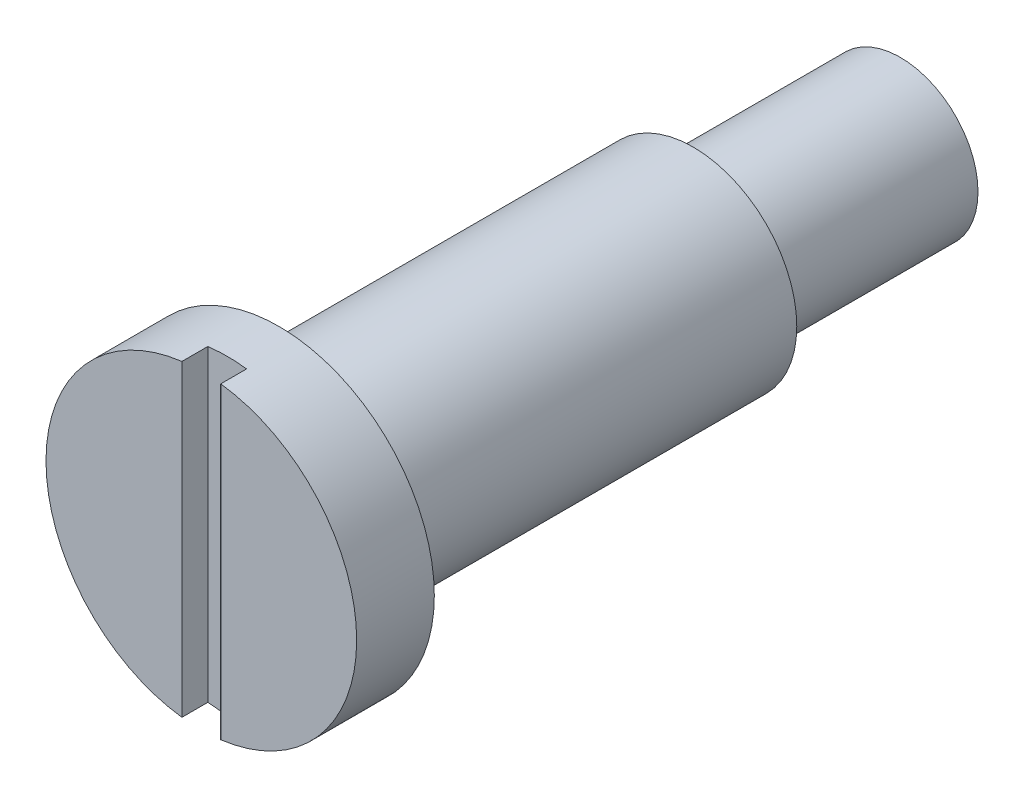
ISO-10303-21;
HEADER;
FILE_DESCRIPTION(('STEP AP214'),'2;1');
FILE_NAME('part.step','',(''),(''),'','','');
FILE_SCHEMA(('AUTOMOTIVE_DESIGN { 1 0 10303 214 1 1 1 1 }'));
ENDSEC;
DATA;
#1=APPLICATION_CONTEXT('core data for automotive mechanical design processes');
#2=APPLICATION_PROTOCOL_DEFINITION('international standard','automotive_design',2000,#1);
#3=PRODUCT_CONTEXT('',#1,'mechanical');
#4=PRODUCT('Part','Part','',(#3));
#5=PRODUCT_RELATED_PRODUCT_CATEGORY('part','',(#4));
#6=PRODUCT_DEFINITION_FORMATION('','',#4);
#7=PRODUCT_DEFINITION_CONTEXT('part definition',#1,'design');
#8=PRODUCT_DEFINITION('design','',#6,#7);
#9=PRODUCT_DEFINITION_SHAPE('','',#8);
#10=(LENGTH_UNIT() NAMED_UNIT(*) SI_UNIT(.MILLI.,.METRE.));
#11=(NAMED_UNIT(*) PLANE_ANGLE_UNIT() SI_UNIT($,.RADIAN.));
#12=(NAMED_UNIT(*) SI_UNIT($,.STERADIAN.) SOLID_ANGLE_UNIT());
#13=UNCERTAINTY_MEASURE_WITH_UNIT(LENGTH_MEASURE(1.E-05),#10,'distance_accuracy_value','');
#14=(GEOMETRIC_REPRESENTATION_CONTEXT(3) GLOBAL_UNCERTAINTY_ASSIGNED_CONTEXT((#13)) GLOBAL_UNIT_ASSIGNED_CONTEXT((#10,
#11,#12)) REPRESENTATION_CONTEXT('',''));
#15=CARTESIAN_POINT('',(0.,0.,0.));
#16=DIRECTION('',(0.,0.,1.));
#17=DIRECTION('',(1.,0.,0.));
#18=AXIS2_PLACEMENT_3D('',#15,#16,#17);
#19=CARTESIAN_POINT('',(0.,0.,0.));
#20=DIRECTION('',(0.,0.,-1.));
#21=DIRECTION('',(-1.,0.,0.));
#22=AXIS2_PLACEMENT_3D('',#19,#20,#21);
#23=PLANE('',#22);
#24=CARTESIAN_POINT('',(0.,0.,0.));
#25=DIRECTION('',(0.,0.,1.));
#26=DIRECTION('',(1.,0.,0.));
#27=AXIS2_PLACEMENT_3D('',#24,#25,#26);
#28=CIRCLE('',#27,6.);
#29=CARTESIAN_POINT('',(-0.75,5.95294044989533,0.));
#30=VERTEX_POINT('',#29);
#31=CARTESIAN_POINT('',(-0.749999999999998,-5.95294044989533,0.));
#32=VERTEX_POINT('',#31);
#33=EDGE_CURVE('E87',#30,#32,#28,.T.);
#34=ORIENTED_EDGE('',*,*,#33,.T.);
#35=DIRECTION('',(0.,-1.,0.));
#36=VECTOR('',#35,1.);
#37=CARTESIAN_POINT('',(-0.75,6.,0.));
#38=LINE('',#37,#36);
#39=EDGE_CURVE('E81',#30,#32,#38,.T.);
#40=ORIENTED_EDGE('',*,*,#39,.F.);
#41=EDGE_LOOP('',(#34,#40));
#42=FACE_BOUND('',#41,.T.);
#43=ADVANCED_FACE('F37',(#42),#23,.F.);
#44=CARTESIAN_POINT('',(0.750000000000001,-5.95294044989533,0.));
#45=VERTEX_POINT('',#44);
#46=CARTESIAN_POINT('',(0.75,5.95294044989533,0.));
#47=VERTEX_POINT('',#46);
#48=EDGE_CURVE('E93',#45,#47,#28,.T.);
#49=ORIENTED_EDGE('',*,*,#48,.T.);
#50=DIRECTION('',(0.,1.,0.));
#51=VECTOR('',#50,1.);
#52=CARTESIAN_POINT('',(0.75,6.,0.));
#53=LINE('',#52,#51);
#54=EDGE_CURVE('E88',#45,#47,#53,.T.);
#55=ORIENTED_EDGE('',*,*,#54,.F.);
#56=EDGE_LOOP('',(#49,#55));
#57=FACE_BOUND('',#56,.T.);
#58=ADVANCED_FACE('F39',(#57),#23,.F.);
#59=CARTESIAN_POINT('',(0.,0.,0.));
#60=DIRECTION('',(0.,0.,1.));
#61=DIRECTION('',(1.,0.,0.));
#62=AXIS2_PLACEMENT_3D('',#59,#60,#61);
#63=CYLINDRICAL_SURFACE('',#62,6.);
#64=ORIENTED_EDGE('',*,*,#33,.F.);
#65=DIRECTION('',(0.,0.,1.));
#66=VECTOR('',#65,1.);
#67=CARTESIAN_POINT('',(-0.75,5.95294044989533,0.));
#68=LINE('',#67,#66);
#69=CARTESIAN_POINT('',(-0.75,5.95294044989533,-1.));
#70=VERTEX_POINT('',#69);
#71=EDGE_CURVE('E11',#30,#70,#68,.F.);
#72=ORIENTED_EDGE('',*,*,#71,.T.);
#73=CARTESIAN_POINT('',(0.,0.,-1.));
#74=DIRECTION('',(0.,0.,1.));
#75=DIRECTION('',(1.,0.,0.));
#76=AXIS2_PLACEMENT_3D('',#73,#74,#75);
#77=CIRCLE('',#76,6.);
#78=CARTESIAN_POINT('',(0.75,5.95294044989533,-1.));
#79=VERTEX_POINT('',#78);
#80=EDGE_CURVE('E51',#79,#70,#77,.T.);
#81=ORIENTED_EDGE('',*,*,#80,.F.);
#82=DIRECTION('',(0.,0.,1.));
#83=VECTOR('',#82,1.);
#84=CARTESIAN_POINT('',(0.75,5.95294044989533,0.));
#85=LINE('',#84,#83);
#86=EDGE_CURVE('E45',#79,#47,#85,.T.);
#87=ORIENTED_EDGE('',*,*,#86,.T.);
#88=ORIENTED_EDGE('',*,*,#48,.F.);
#89=DIRECTION('',(0.,0.,1.));
#90=VECTOR('',#89,1.);
#91=CARTESIAN_POINT('',(0.750000000000002,-5.95294044989533,0.));
#92=LINE('',#91,#90);
#93=CARTESIAN_POINT('',(0.750000000000001,-5.95294044989533,-1.));
#94=VERTEX_POINT('',#93);
#95=EDGE_CURVE('E95',#45,#94,#92,.F.);
#96=ORIENTED_EDGE('',*,*,#95,.T.);
#97=CARTESIAN_POINT('',(-0.749999999999998,-5.95294044989533,-1.));
#98=VERTEX_POINT('',#97);
#99=EDGE_CURVE('E59',#98,#94,#77,.T.);
#100=ORIENTED_EDGE('',*,*,#99,.F.);
#101=DIRECTION('',(0.,0.,1.));
#102=VECTOR('',#101,1.);
#103=CARTESIAN_POINT('',(-0.749999999999998,-5.95294044989533,0.));
#104=LINE('',#103,#102);
#105=EDGE_CURVE('E92',#98,#32,#104,.T.);
#106=ORIENTED_EDGE('',*,*,#105,.T.);
#107=EDGE_LOOP('',(#64,#72,#81,#87,#88,#96,#100,#106));
#108=FACE_BOUND('',#107,.T.);
#109=CARTESIAN_POINT('',(0.,0.,-3.));
#110=DIRECTION('',(0.,0.,1.));
#111=DIRECTION('',(1.,0.,0.));
#112=AXIS2_PLACEMENT_3D('',#109,#110,#111);
#113=CIRCLE('',#112,6.);
#114=CARTESIAN_POINT('',(6.,0.,-3.));
#115=VERTEX_POINT('',#114);
#116=EDGE_CURVE('E98',#115,#115,#113,.T.);
#117=ORIENTED_EDGE('',*,*,#116,.T.);
#118=EDGE_LOOP('',(#117));
#119=FACE_BOUND('',#118,.T.);
#120=ADVANCED_FACE('F90',(#108,#119),#63,.T.);
#121=CARTESIAN_POINT('',(0.,6.,-3.));
#122=DIRECTION('',(0.,0.,1.));
#123=DIRECTION('',(1.,0.,0.));
#124=AXIS2_PLACEMENT_3D('',#121,#122,#123);
#125=PLANE('',#124);
#126=ORIENTED_EDGE('',*,*,#116,.F.);
#127=EDGE_LOOP('',(#126));
#128=FACE_BOUND('',#127,.T.);
#129=CARTESIAN_POINT('',(0.,0.,-3.));
#130=DIRECTION('',(0.,0.,1.));
#131=DIRECTION('',(1.,0.,0.));
#132=AXIS2_PLACEMENT_3D('',#129,#130,#131);
#133=CIRCLE('',#132,4.);
#134=CARTESIAN_POINT('',(4.,0.,-3.));
#135=VERTEX_POINT('',#134);
#136=EDGE_CURVE('E120',#135,#135,#133,.T.);
#137=ORIENTED_EDGE('',*,*,#136,.T.);
#138=EDGE_LOOP('',(#137));
#139=FACE_BOUND('',#138,.T.);
#140=ADVANCED_FACE('F127',(#128,#139),#125,.F.);
#141=CARTESIAN_POINT('',(0.,0.,0.));
#142=DIRECTION('',(0.,0.,1.));
#143=DIRECTION('',(1.,0.,0.));
#144=AXIS2_PLACEMENT_3D('',#141,#142,#143);
#145=CYLINDRICAL_SURFACE('',#144,4.);
#146=ORIENTED_EDGE('',*,*,#136,.F.);
#147=EDGE_LOOP('',(#146));
#148=FACE_BOUND('',#147,.T.);
#149=CARTESIAN_POINT('',(0.,0.,-19.));
#150=DIRECTION('',(0.,0.,1.));
#151=DIRECTION('',(1.,0.,0.));
#152=AXIS2_PLACEMENT_3D('',#149,#150,#151);
#153=CIRCLE('',#152,4.);
#154=CARTESIAN_POINT('',(4.,0.,-19.));
#155=VERTEX_POINT('',#154);
#156=EDGE_CURVE('E118',#155,#155,#153,.T.);
#157=ORIENTED_EDGE('',*,*,#156,.T.);
#158=EDGE_LOOP('',(#157));
#159=FACE_BOUND('',#158,.T.);
#160=ADVANCED_FACE('F129',(#148,#159),#145,.T.);
#161=CARTESIAN_POINT('',(0.,4.,-19.));
#162=DIRECTION('',(0.,0.,1.));
#163=DIRECTION('',(1.,0.,0.));
#164=AXIS2_PLACEMENT_3D('',#161,#162,#163);
#165=PLANE('',#164);
#166=ORIENTED_EDGE('',*,*,#156,.F.);
#167=EDGE_LOOP('',(#166));
#168=FACE_BOUND('',#167,.T.);
#169=CARTESIAN_POINT('',(0.,0.,-19.));
#170=DIRECTION('',(0.,0.,1.));
#171=DIRECTION('',(1.,0.,0.));
#172=AXIS2_PLACEMENT_3D('',#169,#170,#171);
#173=CIRCLE('',#172,3.);
#174=CARTESIAN_POINT('',(3.,0.,-19.));
#175=VERTEX_POINT('',#174);
#176=EDGE_CURVE('E111',#175,#175,#173,.T.);
#177=ORIENTED_EDGE('',*,*,#176,.T.);
#178=EDGE_LOOP('',(#177));
#179=FACE_BOUND('',#178,.T.);
#180=ADVANCED_FACE('F135',(#168,#179),#165,.F.);
#181=CARTESIAN_POINT('',(0.,0.,0.));
#182=DIRECTION('',(0.,0.,1.));
#183=DIRECTION('',(1.,0.,0.));
#184=AXIS2_PLACEMENT_3D('',#181,#182,#183);
#185=CYLINDRICAL_SURFACE('',#184,3.);
#186=ORIENTED_EDGE('',*,*,#176,.F.);
#187=EDGE_LOOP('',(#186));
#188=FACE_BOUND('',#187,.T.);
#189=CARTESIAN_POINT('',(0.,0.,-27.));
#190=DIRECTION('',(0.,0.,1.));
#191=DIRECTION('',(1.,0.,0.));
#192=AXIS2_PLACEMENT_3D('',#189,#190,#191);
#193=CIRCLE('',#192,3.);
#194=CARTESIAN_POINT('',(3.,0.,-27.));
#195=VERTEX_POINT('',#194);
#196=EDGE_CURVE('E108',#195,#195,#193,.T.);
#197=ORIENTED_EDGE('',*,*,#196,.T.);
#198=EDGE_LOOP('',(#197));
#199=FACE_BOUND('',#198,.T.);
#200=ADVANCED_FACE('F159',(#188,#199),#185,.T.);
#201=CARTESIAN_POINT('',(0.,3.,-27.));
#202=DIRECTION('',(0.,0.,1.));
#203=DIRECTION('',(1.,0.,0.));
#204=AXIS2_PLACEMENT_3D('',#201,#202,#203);
#205=PLANE('',#204);
#206=ORIENTED_EDGE('',*,*,#196,.F.);
#207=EDGE_LOOP('',(#206));
#208=FACE_BOUND('',#207,.T.);
#209=ADVANCED_FACE('F154',(#208),#205,.F.);
#210=CARTESIAN_POINT('',(-0.75,6.,-1.));
#211=DIRECTION('',(-1.,0.,0.));
#212=DIRECTION('',(0.,-1.,0.));
#213=AXIS2_PLACEMENT_3D('',#210,#211,#212);
#214=PLANE('',#213);
#215=DIRECTION('',(0.,-1.,0.));
#216=VECTOR('',#215,1.);
#217=CARTESIAN_POINT('',(-0.75,6.,-1.));
#218=LINE('',#217,#216);
#219=EDGE_CURVE('E83',#70,#98,#218,.T.);
#220=ORIENTED_EDGE('',*,*,#219,.F.);
#221=ORIENTED_EDGE('',*,*,#71,.F.);
#222=ORIENTED_EDGE('',*,*,#39,.T.);
#223=ORIENTED_EDGE('',*,*,#105,.F.);
#224=EDGE_LOOP('',(#220,#221,#222,#223));
#225=FACE_BOUND('',#224,.T.);
#226=ADVANCED_FACE('F79',(#225),#214,.F.);
#227=CARTESIAN_POINT('',(0.75,6.,-1.));
#228=DIRECTION('',(1.,0.,0.));
#229=DIRECTION('',(0.,1.,0.));
#230=AXIS2_PLACEMENT_3D('',#227,#228,#229);
#231=PLANE('',#230);
#232=DIRECTION('',(0.,1.,0.));
#233=VECTOR('',#232,1.);
#234=CARTESIAN_POINT('',(0.75,6.,-1.));
#235=LINE('',#234,#233);
#236=EDGE_CURVE('E106',#94,#79,#235,.T.);
#237=ORIENTED_EDGE('',*,*,#236,.F.);
#238=ORIENTED_EDGE('',*,*,#95,.F.);
#239=ORIENTED_EDGE('',*,*,#54,.T.);
#240=ORIENTED_EDGE('',*,*,#86,.F.);
#241=EDGE_LOOP('',(#237,#238,#239,#240));
#242=FACE_BOUND('',#241,.T.);
#243=ADVANCED_FACE('F146',(#242),#231,.F.);
#244=CARTESIAN_POINT('',(0.,0.,-1.));
#245=DIRECTION('',(0.,0.,1.));
#246=DIRECTION('',(1.,0.,0.));
#247=AXIS2_PLACEMENT_3D('',#244,#245,#246);
#248=PLANE('',#247);
#249=ORIENTED_EDGE('',*,*,#236,.T.);
#250=ORIENTED_EDGE('',*,*,#80,.T.);
#251=ORIENTED_EDGE('',*,*,#219,.T.);
#252=ORIENTED_EDGE('',*,*,#99,.T.);
#253=EDGE_LOOP('',(#249,#250,#251,#252));
#254=FACE_BOUND('',#253,.T.);
#255=ADVANCED_FACE('F105',(#254),#248,.T.);
#256=CLOSED_SHELL('',(#43,#58,#120,#140,#160,#180,#200,#209,#226,#243,#255));
#257=MANIFOLD_SOLID_BREP('B2',#256);
#258=ADVANCED_BREP_SHAPE_REPRESENTATION('',(#18,#257),#14);
#259=SHAPE_DEFINITION_REPRESENTATION(#9,#258);
ENDSEC;
END-ISO-10303-21;
